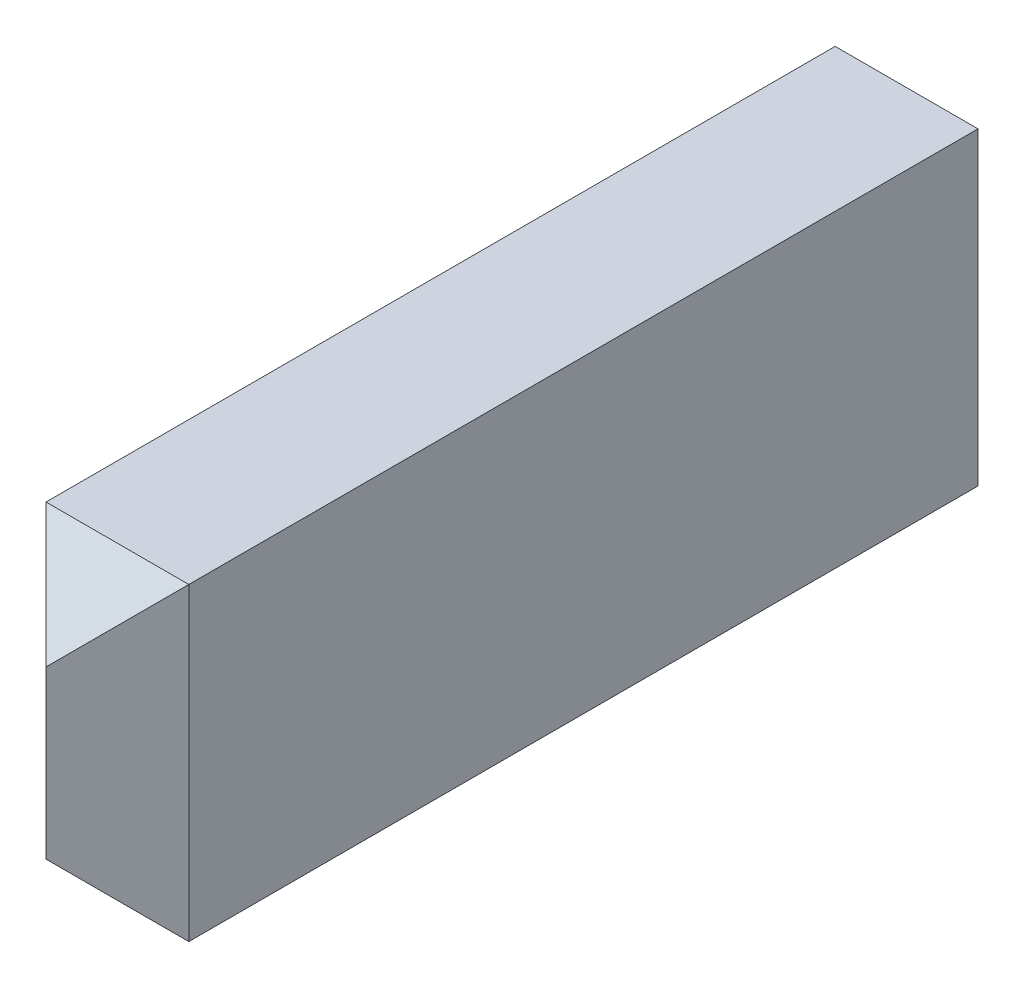
ISO-10303-21;
HEADER;
FILE_DESCRIPTION(('STEP AP214'),'2;1');
FILE_NAME('part.step','',(''),(''),'','','');
FILE_SCHEMA(('AUTOMOTIVE_DESIGN { 1 0 10303 214 1 1 1 1 }'));
ENDSEC;
DATA;
#1=APPLICATION_CONTEXT('core data for automotive mechanical design processes');
#2=APPLICATION_PROTOCOL_DEFINITION('international standard','automotive_design',2000,#1);
#3=PRODUCT_CONTEXT('',#1,'mechanical');
#4=PRODUCT('Part','Part','',(#3));
#5=PRODUCT_RELATED_PRODUCT_CATEGORY('part','',(#4));
#6=PRODUCT_DEFINITION_FORMATION('','',#4);
#7=PRODUCT_DEFINITION_CONTEXT('part definition',#1,'design');
#8=PRODUCT_DEFINITION('design','',#6,#7);
#9=PRODUCT_DEFINITION_SHAPE('','',#8);
#10=(LENGTH_UNIT() NAMED_UNIT(*) SI_UNIT(.MILLI.,.METRE.));
#11=(NAMED_UNIT(*) PLANE_ANGLE_UNIT() SI_UNIT($,.RADIAN.));
#12=(NAMED_UNIT(*) SI_UNIT($,.STERADIAN.) SOLID_ANGLE_UNIT());
#13=UNCERTAINTY_MEASURE_WITH_UNIT(LENGTH_MEASURE(1.E-05),#10,'distance_accuracy_value','');
#14=(GEOMETRIC_REPRESENTATION_CONTEXT(3) GLOBAL_UNCERTAINTY_ASSIGNED_CONTEXT((#13)) GLOBAL_UNIT_ASSIGNED_CONTEXT((#10,
#11,#12)) REPRESENTATION_CONTEXT('',''));
#15=CARTESIAN_POINT('',(0.,0.,0.));
#16=DIRECTION('',(0.,0.,1.));
#17=DIRECTION('',(1.,0.,0.));
#18=AXIS2_PLACEMENT_3D('',#15,#16,#17);
#19=CARTESIAN_POINT('',(-8.639175,-12.8143,-2.276475));
#20=DIRECTION('',(-0.707106781186548,0.,0.707106781186548));
#21=DIRECTION('',(0.707106781186548,0.,0.707106781186548));
#22=AXIS2_PLACEMENT_3D('',#19,#20,#21);
#23=PLANE('',#22);
#24=DIRECTION('',(0.,1.,0.));
#25=VECTOR('',#24,1.);
#26=CARTESIAN_POINT('',(-9.13765,-13.8938,-2.77495));
#27=LINE('',#26,#25);
#28=CARTESIAN_POINT('',(-9.13765,-13.8938,-2.77495));
#29=VERTEX_POINT('',#28);
#30=CARTESIAN_POINT('',(-9.13765,-9.5758,-2.77495));
#31=VERTEX_POINT('',#30);
#32=EDGE_CURVE('E66',#29,#31,#27,.T.);
#33=ORIENTED_EDGE('',*,*,#32,.F.);
#34=DIRECTION('',(-0.577350269189626,-0.577350269189627,-0.577350269189625));
#35=VECTOR('',#34,1.);
#36=CARTESIAN_POINT('',(-8.1407,-12.89685,-1.778));
#37=LINE('',#36,#35);
#38=CARTESIAN_POINT('',(-8.1407,-12.89685,-1.778));
#39=VERTEX_POINT('',#38);
#40=EDGE_CURVE('E20',#39,#29,#37,.T.);
#41=ORIENTED_EDGE('',*,*,#40,.F.);
#42=DIRECTION('',(0.,1.,0.));
#43=VECTOR('',#42,1.);
#44=CARTESIAN_POINT('',(-8.1407,-10.6553,-1.778));
#45=LINE('',#44,#43);
#46=CARTESIAN_POINT('',(-8.1407,-10.57275,-1.778));
#47=VERTEX_POINT('',#46);
#48=EDGE_CURVE('E61',#47,#39,#45,.F.);
#49=ORIENTED_EDGE('',*,*,#48,.F.);
#50=DIRECTION('',(0.577350269189626,-0.577350269189625,0.577350269189626));
#51=VECTOR('',#50,1.);
#52=CARTESIAN_POINT('',(-9.13765,-9.5758,-2.77495));
#53=LINE('',#52,#51);
#54=EDGE_CURVE('E69',#31,#47,#53,.T.);
#55=ORIENTED_EDGE('',*,*,#54,.F.);
#56=EDGE_LOOP('',(#33,#41,#49,#55));
#57=FACE_BOUND('',#56,.T.);
#58=ADVANCED_FACE('F17',(#57),#23,.T.);
#59=CARTESIAN_POINT('',(-7.642225,-13.395325,-2.276475));
#60=DIRECTION('',(0.,-0.707106781186546,0.707106781186549));
#61=DIRECTION('',(0.,-0.707106781186549,-0.707106781186546));
#62=AXIS2_PLACEMENT_3D('',#59,#60,#61);
#63=PLANE('',#62);
#64=DIRECTION('',(1.,0.,0.));
#65=VECTOR('',#64,1.);
#66=CARTESIAN_POINT('',(-7.14375,-13.8938,-2.77495));
#67=LINE('',#66,#65);
#68=CARTESIAN_POINT('',(-7.14375,-13.8938,-2.77495));
#69=VERTEX_POINT('',#68);
#70=EDGE_CURVE('E74',#69,#29,#67,.F.);
#71=ORIENTED_EDGE('',*,*,#70,.F.);
#72=DIRECTION('',(0.577350269189626,-0.577350269189626,-0.577350269189626));
#73=VECTOR('',#72,1.);
#74=CARTESIAN_POINT('',(-8.1407,-12.89685,-1.778));
#75=LINE('',#74,#73);
#76=EDGE_CURVE('E71',#39,#69,#75,.T.);
#77=ORIENTED_EDGE('',*,*,#76,.F.);
#78=ORIENTED_EDGE('',*,*,#40,.T.);
#79=EDGE_LOOP('',(#71,#77,#78));
#80=FACE_BOUND('',#79,.T.);
#81=ADVANCED_FACE('F72',(#80),#63,.T.);
#82=CARTESIAN_POINT('',(-8.639175,-10.074275,-2.276475));
#83=DIRECTION('',(0.,0.707106781186548,0.707106781186547));
#84=DIRECTION('',(0.,-0.707106781186547,0.707106781186548));
#85=AXIS2_PLACEMENT_3D('',#82,#83,#84);
#86=PLANE('',#85);
#87=DIRECTION('',(1.,0.,0.));
#88=VECTOR('',#87,1.);
#89=CARTESIAN_POINT('',(-9.13765,-9.5758,-2.77495));
#90=LINE('',#89,#88);
#91=CARTESIAN_POINT('',(-7.14375,-9.5758,-2.77495));
#92=VERTEX_POINT('',#91);
#93=EDGE_CURVE('E89',#31,#92,#90,.T.);
#94=ORIENTED_EDGE('',*,*,#93,.F.);
#95=ORIENTED_EDGE('',*,*,#54,.T.);
#96=DIRECTION('',(-0.577350269189626,-0.577350269189625,0.577350269189626));
#97=VECTOR('',#96,1.);
#98=CARTESIAN_POINT('',(-7.14375,-9.5758,-2.77495));
#99=LINE('',#98,#97);
#100=EDGE_CURVE('E78',#92,#47,#99,.T.);
#101=ORIENTED_EDGE('',*,*,#100,.F.);
#102=EDGE_LOOP('',(#94,#95,#101));
#103=FACE_BOUND('',#102,.T.);
#104=ADVANCED_FACE('F87',(#103),#86,.T.);
#105=CARTESIAN_POINT('',(-9.13765,-13.8938,-13.7922));
#106=DIRECTION('',(-1.,0.,0.));
#107=DIRECTION('',(0.,0.,1.));
#108=AXIS2_PLACEMENT_3D('',#105,#106,#107);
#109=PLANE('',#108);
#110=DIRECTION('',(0.,1.,0.));
#111=VECTOR('',#110,1.);
#112=CARTESIAN_POINT('',(-9.13765,0.43180000000044,-13.7922000000013));
#113=LINE('',#112,#111);
#114=CARTESIAN_POINT('',(-9.13765,-9.5758,-13.7922000000006));
#115=VERTEX_POINT('',#114);
#116=CARTESIAN_POINT('',(-9.13765,-13.8938,-13.7922000000003));
#117=VERTEX_POINT('',#116);
#118=EDGE_CURVE('E110',#115,#117,#113,.F.);
#119=ORIENTED_EDGE('',*,*,#118,.T.);
#120=DIRECTION('',(0.,0.,-1.));
#121=VECTOR('',#120,1.);
#122=CARTESIAN_POINT('',(-9.13765,-13.8938,-13.7922));
#123=LINE('',#122,#121);
#124=EDGE_CURVE('E99',#29,#117,#123,.T.);
#125=ORIENTED_EDGE('',*,*,#124,.F.);
#126=ORIENTED_EDGE('',*,*,#32,.T.);
#127=DIRECTION('',(0.,0.,1.));
#128=VECTOR('',#127,1.);
#129=CARTESIAN_POINT('',(-9.13765,-9.5758,-13.7922));
#130=LINE('',#129,#128);
#131=EDGE_CURVE('E97',#115,#31,#130,.T.);
#132=ORIENTED_EDGE('',*,*,#131,.F.);
#133=EDGE_LOOP('',(#119,#125,#126,#132));
#134=FACE_BOUND('',#133,.T.);
#135=ADVANCED_FACE('F96',(#134),#109,.T.);
#136=CARTESIAN_POINT('',(-7.642225,-10.6553,-2.276475));
#137=DIRECTION('',(0.707106781186548,0.,0.707106781186548));
#138=DIRECTION('',(0.707106781186548,0.,-0.707106781186548));
#139=AXIS2_PLACEMENT_3D('',#136,#137,#138);
#140=PLANE('',#139);
#141=DIRECTION('',(0.,1.,0.));
#142=VECTOR('',#141,1.);
#143=CARTESIAN_POINT('',(-7.14375,-9.5758,-2.77495));
#144=LINE('',#143,#142);
#145=EDGE_CURVE('E101',#92,#69,#144,.F.);
#146=ORIENTED_EDGE('',*,*,#145,.F.);
#147=ORIENTED_EDGE('',*,*,#100,.T.);
#148=ORIENTED_EDGE('',*,*,#48,.T.);
#149=ORIENTED_EDGE('',*,*,#76,.T.);
#150=EDGE_LOOP('',(#146,#147,#148,#149));
#151=FACE_BOUND('',#150,.T.);
#152=ADVANCED_FACE('F81',(#151),#140,.T.);
#153=CARTESIAN_POINT('',(-7.14375,-13.8938,-13.7922));
#154=DIRECTION('',(0.,-1.,0.));
#155=DIRECTION('',(0.,0.,-1.));
#156=AXIS2_PLACEMENT_3D('',#153,#154,#155);
#157=PLANE('',#156);
#158=DIRECTION('',(1.,0.,0.));
#159=VECTOR('',#158,1.);
#160=CARTESIAN_POINT('',(-1.77635683940025E-13,-13.8938,-13.7922000000013));
#161=LINE('',#160,#159);
#162=CARTESIAN_POINT('',(-7.14375,-13.8938,-13.7922000000003));
#163=VERTEX_POINT('',#162);
#164=EDGE_CURVE('E92',#117,#163,#161,.T.);
#165=ORIENTED_EDGE('',*,*,#164,.T.);
#166=DIRECTION('',(0.,0.,-1.));
#167=VECTOR('',#166,1.);
#168=CARTESIAN_POINT('',(-7.14375,-13.8938,-13.7922));
#169=LINE('',#168,#167);
#170=EDGE_CURVE('E104',#69,#163,#169,.T.);
#171=ORIENTED_EDGE('',*,*,#170,.F.);
#172=ORIENTED_EDGE('',*,*,#70,.T.);
#173=ORIENTED_EDGE('',*,*,#124,.T.);
#174=EDGE_LOOP('',(#165,#171,#172,#173));
#175=FACE_BOUND('',#174,.T.);
#176=ADVANCED_FACE('F114',(#175),#157,.T.);
#177=CARTESIAN_POINT('',(-1.77635683940025E-13,0.43180000000044,-13.7922000000013));
#178=DIRECTION('',(0.,0.,1.));
#179=DIRECTION('',(1.,0.,0.));
#180=AXIS2_PLACEMENT_3D('',#177,#178,#179);
#181=PLANE('',#180);
#182=ORIENTED_EDGE('',*,*,#118,.F.);
#183=DIRECTION('',(1.,0.,0.));
#184=VECTOR('',#183,1.);
#185=CARTESIAN_POINT('',(-9.13765,-9.5758,-13.7922));
#186=LINE('',#185,#184);
#187=CARTESIAN_POINT('',(-7.14375,-9.5758,-13.7922000000006));
#188=VERTEX_POINT('',#187);
#189=EDGE_CURVE('E35',#188,#115,#186,.F.);
#190=ORIENTED_EDGE('',*,*,#189,.F.);
#191=DIRECTION('',(0.,1.,0.));
#192=VECTOR('',#191,1.);
#193=CARTESIAN_POINT('',(-7.14375,-9.5758,-13.7922));
#194=LINE('',#193,#192);
#195=EDGE_CURVE('E26',#163,#188,#194,.T.);
#196=ORIENTED_EDGE('',*,*,#195,.F.);
#197=ORIENTED_EDGE('',*,*,#164,.F.);
#198=EDGE_LOOP('',(#182,#190,#196,#197));
#199=FACE_BOUND('',#198,.T.);
#200=ADVANCED_FACE('F121',(#199),#181,.F.);
#201=CARTESIAN_POINT('',(-9.13765,-9.5758,-13.7922));
#202=DIRECTION('',(0.,1.,0.));
#203=DIRECTION('',(0.,0.,1.));
#204=AXIS2_PLACEMENT_3D('',#201,#202,#203);
#205=PLANE('',#204);
#206=ORIENTED_EDGE('',*,*,#189,.T.);
#207=ORIENTED_EDGE('',*,*,#131,.T.);
#208=ORIENTED_EDGE('',*,*,#93,.T.);
#209=DIRECTION('',(0.,0.,-1.));
#210=VECTOR('',#209,1.);
#211=CARTESIAN_POINT('',(-7.14375,-9.5758,-13.7922));
#212=LINE('',#211,#210);
#213=EDGE_CURVE('E11',#188,#92,#212,.F.);
#214=ORIENTED_EDGE('',*,*,#213,.F.);
#215=EDGE_LOOP('',(#206,#207,#208,#214));
#216=FACE_BOUND('',#215,.T.);
#217=ADVANCED_FACE('F100',(#216),#205,.T.);
#218=CARTESIAN_POINT('',(-7.14375,-9.5758,-13.7922));
#219=DIRECTION('',(1.,0.,0.));
#220=DIRECTION('',(0.,0.,-1.));
#221=AXIS2_PLACEMENT_3D('',#218,#219,#220);
#222=PLANE('',#221);
#223=ORIENTED_EDGE('',*,*,#195,.T.);
#224=ORIENTED_EDGE('',*,*,#213,.T.);
#225=ORIENTED_EDGE('',*,*,#145,.T.);
#226=ORIENTED_EDGE('',*,*,#170,.T.);
#227=EDGE_LOOP('',(#223,#224,#225,#226));
#228=FACE_BOUND('',#227,.T.);
#229=ADVANCED_FACE('F119',(#228),#222,.T.);
#230=CLOSED_SHELL('',(#58,#81,#104,#135,#152,#176,#200,#217,#229));
#231=MANIFOLD_SOLID_BREP('B1',#230);
#232=ADVANCED_BREP_SHAPE_REPRESENTATION('',(#18,#231),#14);
#233=SHAPE_DEFINITION_REPRESENTATION(#9,#232);
ENDSEC;
END-ISO-10303-21;
